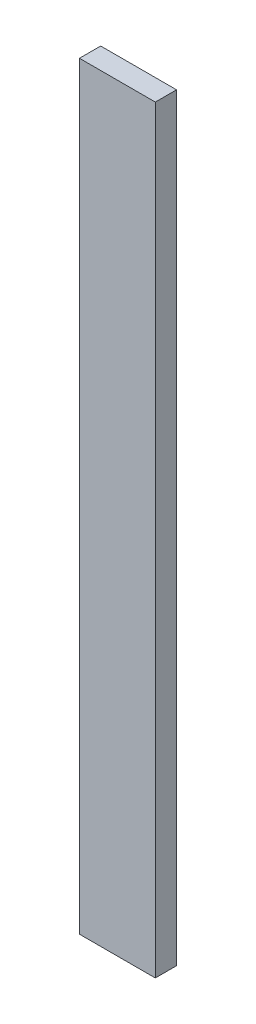
ISO-10303-21;
HEADER;
FILE_DESCRIPTION(('STEP AP214'),'2;1');
FILE_NAME('part.step','',(''),(''),'','','');
FILE_SCHEMA(('AUTOMOTIVE_DESIGN { 1 0 10303 214 1 1 1 1 }'));
ENDSEC;
DATA;
#1=APPLICATION_CONTEXT('core data for automotive mechanical design processes');
#2=APPLICATION_PROTOCOL_DEFINITION('international standard','automotive_design',2000,#1);
#3=PRODUCT_CONTEXT('',#1,'mechanical');
#4=PRODUCT('Part','Part','',(#3));
#5=PRODUCT_RELATED_PRODUCT_CATEGORY('part','',(#4));
#6=PRODUCT_DEFINITION_FORMATION('','',#4);
#7=PRODUCT_DEFINITION_CONTEXT('part definition',#1,'design');
#8=PRODUCT_DEFINITION('design','',#6,#7);
#9=PRODUCT_DEFINITION_SHAPE('','',#8);
#10=(LENGTH_UNIT() NAMED_UNIT(*) SI_UNIT(.MILLI.,.METRE.));
#11=(NAMED_UNIT(*) PLANE_ANGLE_UNIT() SI_UNIT($,.RADIAN.));
#12=(NAMED_UNIT(*) SI_UNIT($,.STERADIAN.) SOLID_ANGLE_UNIT());
#13=UNCERTAINTY_MEASURE_WITH_UNIT(LENGTH_MEASURE(1.E-05),#10,'distance_accuracy_value','');
#14=(GEOMETRIC_REPRESENTATION_CONTEXT(3) GLOBAL_UNCERTAINTY_ASSIGNED_CONTEXT((#13)) GLOBAL_UNIT_ASSIGNED_CONTEXT((#10,
#11,#12)) REPRESENTATION_CONTEXT('',''));
#15=CARTESIAN_POINT('',(0.,0.,0.));
#16=DIRECTION('',(0.,0.,1.));
#17=DIRECTION('',(1.,0.,0.));
#18=AXIS2_PLACEMENT_3D('',#15,#16,#17);
#19=CARTESIAN_POINT('',(0.,200.,-5.59791857208591));
#20=DIRECTION('',(1.,0.,0.));
#21=DIRECTION('',(0.,0.,-1.));
#22=AXIS2_PLACEMENT_3D('',#19,#20,#21);
#23=PLANE('',#22);
#24=DIRECTION('',(0.,0.,1.));
#25=VECTOR('',#24,1.);
#26=CARTESIAN_POINT('',(0.,0.,-5.59791857208591));
#27=LINE('',#26,#25);
#28=CARTESIAN_POINT('',(0.,0.,-5.59791857208591));
#29=VERTEX_POINT('',#28);
#30=CARTESIAN_POINT('',(0.,0.,0.));
#31=VERTEX_POINT('',#30);
#32=EDGE_CURVE('E107',#29,#31,#27,.T.);
#33=ORIENTED_EDGE('',*,*,#32,.T.);
#34=DIRECTION('',(0.,-1.,0.));
#35=VECTOR('',#34,1.);
#36=CARTESIAN_POINT('',(0.,200.,0.));
#37=LINE('',#36,#35);
#38=CARTESIAN_POINT('',(0.,200.,0.));
#39=VERTEX_POINT('',#38);
#40=EDGE_CURVE('E11',#39,#31,#37,.T.);
#41=ORIENTED_EDGE('',*,*,#40,.F.);
#42=DIRECTION('',(0.,0.,1.));
#43=VECTOR('',#42,1.);
#44=CARTESIAN_POINT('',(0.,200.,-5.59791857208591));
#45=LINE('',#44,#43);
#46=CARTESIAN_POINT('',(0.,200.,-5.59791857208591));
#47=VERTEX_POINT('',#46);
#48=EDGE_CURVE('E91',#47,#39,#45,.T.);
#49=ORIENTED_EDGE('',*,*,#48,.F.);
#50=DIRECTION('',(0.,-1.,0.));
#51=VECTOR('',#50,1.);
#52=CARTESIAN_POINT('',(0.,200.,-5.59791857208591));
#53=LINE('',#52,#51);
#54=EDGE_CURVE('E103',#47,#29,#53,.T.);
#55=ORIENTED_EDGE('',*,*,#54,.T.);
#56=EDGE_LOOP('',(#33,#41,#49,#55));
#57=FACE_BOUND('',#56,.T.);
#58=ADVANCED_FACE('F39',(#57),#23,.F.);
#59=CARTESIAN_POINT('',(0.,200.,0.));
#60=DIRECTION('',(0.,0.,-1.));
#61=DIRECTION('',(-1.,0.,0.));
#62=AXIS2_PLACEMENT_3D('',#59,#60,#61);
#63=PLANE('',#62);
#64=DIRECTION('',(1.,0.,0.));
#65=VECTOR('',#64,1.);
#66=CARTESIAN_POINT('',(0.,0.,0.));
#67=LINE('',#66,#65);
#68=CARTESIAN_POINT('',(20.,0.,0.));
#69=VERTEX_POINT('',#68);
#70=EDGE_CURVE('E96',#31,#69,#67,.T.);
#71=ORIENTED_EDGE('',*,*,#70,.T.);
#72=DIRECTION('',(0.,-1.,0.));
#73=VECTOR('',#72,1.);
#74=CARTESIAN_POINT('',(20.,200.,0.));
#75=LINE('',#74,#73);
#76=CARTESIAN_POINT('',(20.,200.,0.));
#77=VERTEX_POINT('',#76);
#78=EDGE_CURVE('E48',#77,#69,#75,.T.);
#79=ORIENTED_EDGE('',*,*,#78,.F.);
#80=DIRECTION('',(1.,0.,0.));
#81=VECTOR('',#80,1.);
#82=CARTESIAN_POINT('',(0.,200.,0.));
#83=LINE('',#82,#81);
#84=EDGE_CURVE('E86',#39,#77,#83,.T.);
#85=ORIENTED_EDGE('',*,*,#84,.F.);
#86=ORIENTED_EDGE('',*,*,#40,.T.);
#87=EDGE_LOOP('',(#71,#79,#85,#86));
#88=FACE_BOUND('',#87,.T.);
#89=ADVANCED_FACE('F95',(#88),#63,.F.);
#90=CARTESIAN_POINT('',(20.,200.,-5.59791857208591));
#91=DIRECTION('',(-1.,0.,0.));
#92=DIRECTION('',(0.,0.,1.));
#93=AXIS2_PLACEMENT_3D('',#90,#91,#92);
#94=PLANE('',#93);
#95=DIRECTION('',(0.,0.,-1.));
#96=VECTOR('',#95,1.);
#97=CARTESIAN_POINT('',(20.,0.,-5.59791857208591));
#98=LINE('',#97,#96);
#99=CARTESIAN_POINT('',(20.,0.,-5.59791857208591));
#100=VERTEX_POINT('',#99);
#101=EDGE_CURVE('E73',#69,#100,#98,.T.);
#102=ORIENTED_EDGE('',*,*,#101,.T.);
#103=DIRECTION('',(0.,-1.,0.));
#104=VECTOR('',#103,1.);
#105=CARTESIAN_POINT('',(20.,200.,-5.59791857208591));
#106=LINE('',#105,#104);
#107=CARTESIAN_POINT('',(20.,200.,-5.59791857208591));
#108=VERTEX_POINT('',#107);
#109=EDGE_CURVE('E98',#108,#100,#106,.T.);
#110=ORIENTED_EDGE('',*,*,#109,.F.);
#111=DIRECTION('',(0.,0.,-1.));
#112=VECTOR('',#111,1.);
#113=CARTESIAN_POINT('',(20.,200.,-5.59791857208591));
#114=LINE('',#113,#112);
#115=EDGE_CURVE('E89',#77,#108,#114,.T.);
#116=ORIENTED_EDGE('',*,*,#115,.F.);
#117=ORIENTED_EDGE('',*,*,#78,.T.);
#118=EDGE_LOOP('',(#102,#110,#116,#117));
#119=FACE_BOUND('',#118,.T.);
#120=ADVANCED_FACE('F99',(#119),#94,.F.);
#121=CARTESIAN_POINT('',(0.,200.,-5.59791857208591));
#122=DIRECTION('',(0.,0.,1.));
#123=DIRECTION('',(1.,0.,0.));
#124=AXIS2_PLACEMENT_3D('',#121,#122,#123);
#125=PLANE('',#124);
#126=DIRECTION('',(-1.,0.,0.));
#127=VECTOR('',#126,1.);
#128=CARTESIAN_POINT('',(0.,0.,-5.59791857208591));
#129=LINE('',#128,#127);
#130=EDGE_CURVE('E79',#100,#29,#129,.T.);
#131=ORIENTED_EDGE('',*,*,#130,.T.);
#132=ORIENTED_EDGE('',*,*,#54,.F.);
#133=DIRECTION('',(-1.,0.,0.));
#134=VECTOR('',#133,1.);
#135=CARTESIAN_POINT('',(0.,200.,-5.59791857208591));
#136=LINE('',#135,#134);
#137=EDGE_CURVE('E56',#108,#47,#136,.T.);
#138=ORIENTED_EDGE('',*,*,#137,.F.);
#139=ORIENTED_EDGE('',*,*,#109,.T.);
#140=EDGE_LOOP('',(#131,#132,#138,#139));
#141=FACE_BOUND('',#140,.T.);
#142=ADVANCED_FACE('F120',(#141),#125,.F.);
#143=CARTESIAN_POINT('',(0.,200.,0.));
#144=DIRECTION('',(0.,1.,0.));
#145=DIRECTION('',(0.,0.,1.));
#146=AXIS2_PLACEMENT_3D('',#143,#144,#145);
#147=PLANE('',#146);
#148=ORIENTED_EDGE('',*,*,#48,.T.);
#149=ORIENTED_EDGE('',*,*,#84,.T.);
#150=ORIENTED_EDGE('',*,*,#115,.T.);
#151=ORIENTED_EDGE('',*,*,#137,.T.);
#152=EDGE_LOOP('',(#148,#149,#150,#151));
#153=FACE_BOUND('',#152,.T.);
#154=ADVANCED_FACE('F87',(#153),#147,.T.);
#155=CARTESIAN_POINT('',(0.,0.,0.));
#156=DIRECTION('',(0.,1.,0.));
#157=DIRECTION('',(0.,0.,1.));
#158=AXIS2_PLACEMENT_3D('',#155,#156,#157);
#159=PLANE('',#158);
#160=ORIENTED_EDGE('',*,*,#32,.F.);
#161=ORIENTED_EDGE('',*,*,#130,.F.);
#162=ORIENTED_EDGE('',*,*,#101,.F.);
#163=ORIENTED_EDGE('',*,*,#70,.F.);
#164=EDGE_LOOP('',(#160,#161,#162,#163));
#165=FACE_BOUND('',#164,.T.);
#166=ADVANCED_FACE('F123',(#165),#159,.F.);
#167=CLOSED_SHELL('',(#58,#89,#120,#142,#154,#166));
#168=MANIFOLD_SOLID_BREP('B2',#167);
#169=ADVANCED_BREP_SHAPE_REPRESENTATION('',(#18,#168),#14);
#170=SHAPE_DEFINITION_REPRESENTATION(#9,#169);
ENDSEC;
END-ISO-10303-21;
